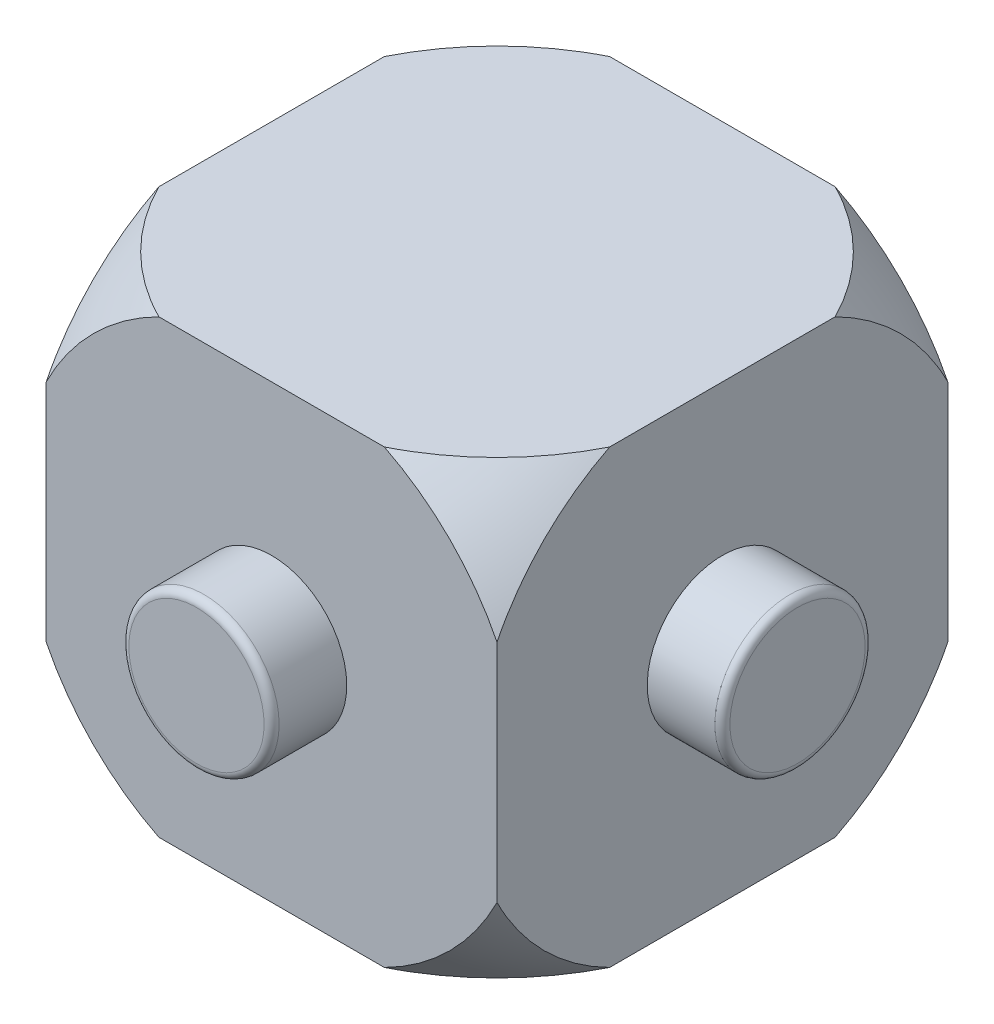
ISO-10303-21;
HEADER;
FILE_DESCRIPTION(('STEP AP214'),'2;1');
FILE_NAME('part.step','',(''),(''),'','','');
FILE_SCHEMA(('AUTOMOTIVE_DESIGN { 1 0 10303 214 1 1 1 1 }'));
ENDSEC;
DATA;
#1=APPLICATION_CONTEXT('core data for automotive mechanical design processes');
#2=APPLICATION_PROTOCOL_DEFINITION('international standard','automotive_design',2000,#1);
#3=PRODUCT_CONTEXT('',#1,'mechanical');
#4=PRODUCT('Part','Part','',(#3));
#5=PRODUCT_RELATED_PRODUCT_CATEGORY('part','',(#4));
#6=PRODUCT_DEFINITION_FORMATION('','',#4);
#7=PRODUCT_DEFINITION_CONTEXT('part definition',#1,'design');
#8=PRODUCT_DEFINITION('design','',#6,#7);
#9=PRODUCT_DEFINITION_SHAPE('','',#8);
#10=(LENGTH_UNIT() NAMED_UNIT(*) SI_UNIT(.MILLI.,.METRE.));
#11=(NAMED_UNIT(*) PLANE_ANGLE_UNIT() SI_UNIT($,.RADIAN.));
#12=(NAMED_UNIT(*) SI_UNIT($,.STERADIAN.) SOLID_ANGLE_UNIT());
#13=UNCERTAINTY_MEASURE_WITH_UNIT(LENGTH_MEASURE(1.E-05),#10,'distance_accuracy_value','');
#14=(GEOMETRIC_REPRESENTATION_CONTEXT(3) GLOBAL_UNCERTAINTY_ASSIGNED_CONTEXT((#13)) GLOBAL_UNIT_ASSIGNED_CONTEXT((#10,
#11,#12)) REPRESENTATION_CONTEXT('',''));
#15=CARTESIAN_POINT('',(0.,0.,0.));
#16=DIRECTION('',(0.,0.,1.));
#17=DIRECTION('',(1.,0.,0.));
#18=AXIS2_PLACEMENT_3D('',#15,#16,#17);
#19=CARTESIAN_POINT('',(3.,3.,3.));
#20=DIRECTION('',(-1.,0.,0.));
#21=DIRECTION('',(0.,-1.,0.));
#22=AXIS2_PLACEMENT_3D('',#19,#20,#21);
#23=PLANE('',#22);
#24=DIRECTION('',(0.,0.,-1.));
#25=VECTOR('',#24,1.);
#26=CARTESIAN_POINT('',(3.,-3.,3.));
#27=LINE('',#26,#25);
#28=CARTESIAN_POINT('',(3.,-3.,1.5));
#29=VERTEX_POINT('',#28);
#30=CARTESIAN_POINT('',(3.,-3.,-1.5));
#31=VERTEX_POINT('',#30);
#32=EDGE_CURVE('E166',#29,#31,#27,.T.);
#33=ORIENTED_EDGE('',*,*,#32,.T.);
#34=CARTESIAN_POINT('',(3.,0.,0.));
#35=DIRECTION('',(-1.,0.,0.));
#36=DIRECTION('',(0.,-1.,0.));
#37=AXIS2_PLACEMENT_3D('',#34,#35,#36);
#38=CIRCLE('',#37,3.35410196624968);
#39=CARTESIAN_POINT('',(3.,-1.5,-3.));
#40=VERTEX_POINT('',#39);
#41=EDGE_CURVE('E288',#31,#40,#38,.F.);
#42=ORIENTED_EDGE('',*,*,#41,.T.);
#43=DIRECTION('',(0.,1.,0.));
#44=VECTOR('',#43,1.);
#45=CARTESIAN_POINT('',(3.,3.,-3.));
#46=LINE('',#45,#44);
#47=CARTESIAN_POINT('',(3.,1.5,-3.));
#48=VERTEX_POINT('',#47);
#49=EDGE_CURVE('E154',#40,#48,#46,.T.);
#50=ORIENTED_EDGE('',*,*,#49,.T.);
#51=CARTESIAN_POINT('',(3.,3.,-1.5));
#52=VERTEX_POINT('',#51);
#53=EDGE_CURVE('E128',#48,#52,#38,.F.);
#54=ORIENTED_EDGE('',*,*,#53,.T.);
#55=DIRECTION('',(0.,0.,-1.));
#56=VECTOR('',#55,1.);
#57=CARTESIAN_POINT('',(3.,3.,3.));
#58=LINE('',#57,#56);
#59=CARTESIAN_POINT('',(3.,3.,1.5));
#60=VERTEX_POINT('',#59);
#61=EDGE_CURVE('E134',#60,#52,#58,.T.);
#62=ORIENTED_EDGE('',*,*,#61,.F.);
#63=CARTESIAN_POINT('',(3.,1.5,3.));
#64=VERTEX_POINT('',#63);
#65=EDGE_CURVE('E502',#60,#64,#38,.F.);
#66=ORIENTED_EDGE('',*,*,#65,.T.);
#67=DIRECTION('',(0.,1.,0.));
#68=VECTOR('',#67,1.);
#69=CARTESIAN_POINT('',(3.,3.,3.));
#70=LINE('',#69,#68);
#71=CARTESIAN_POINT('',(3.,-1.5,3.));
#72=VERTEX_POINT('',#71);
#73=EDGE_CURVE('E165',#72,#64,#70,.T.);
#74=ORIENTED_EDGE('',*,*,#73,.F.);
#75=EDGE_CURVE('E159',#72,#29,#38,.F.);
#76=ORIENTED_EDGE('',*,*,#75,.T.);
#77=EDGE_LOOP('',(#33,#42,#50,#54,#62,#66,#74,#76));
#78=FACE_BOUND('',#77,.T.);
#79=CARTESIAN_POINT('',(3.,0.,0.));
#80=DIRECTION('',(-1.,0.,0.));
#81=DIRECTION('',(0.,-1.,0.));
#82=AXIS2_PLACEMENT_3D('',#79,#80,#81);
#83=CIRCLE('',#82,1.);
#84=CARTESIAN_POINT('',(3.,-1.,0.));
#85=VERTEX_POINT('',#84);
#86=EDGE_CURVE('E183',#85,#85,#83,.F.);
#87=ORIENTED_EDGE('',*,*,#86,.F.);
#88=EDGE_LOOP('',(#87));
#89=FACE_BOUND('',#88,.T.);
#90=ADVANCED_FACE('F35',(#78,#89),#23,.F.);
#91=CARTESIAN_POINT('',(-3.,3.,3.));
#92=DIRECTION('',(1.,0.,0.));
#93=DIRECTION('',(0.,1.,0.));
#94=AXIS2_PLACEMENT_3D('',#91,#92,#93);
#95=PLANE('',#94);
#96=DIRECTION('',(0.,0.,-1.));
#97=VECTOR('',#96,1.);
#98=CARTESIAN_POINT('',(-3.,3.,3.));
#99=LINE('',#98,#97);
#100=CARTESIAN_POINT('',(-3.,3.,1.5));
#101=VERTEX_POINT('',#100);
#102=CARTESIAN_POINT('',(-3.,3.,-1.5));
#103=VERTEX_POINT('',#102);
#104=EDGE_CURVE('E173',#101,#103,#99,.T.);
#105=ORIENTED_EDGE('',*,*,#104,.T.);
#106=CARTESIAN_POINT('',(-3.,0.,0.));
#107=DIRECTION('',(1.,0.,0.));
#108=DIRECTION('',(0.,1.,0.));
#109=AXIS2_PLACEMENT_3D('',#106,#107,#108);
#110=CIRCLE('',#109,3.35410196624968);
#111=CARTESIAN_POINT('',(-3.,1.5,-3.));
#112=VERTEX_POINT('',#111);
#113=EDGE_CURVE('E296',#103,#112,#110,.F.);
#114=ORIENTED_EDGE('',*,*,#113,.T.);
#115=DIRECTION('',(0.,-1.,0.));
#116=VECTOR('',#115,1.);
#117=CARTESIAN_POINT('',(-3.,3.,-3.));
#118=LINE('',#117,#116);
#119=CARTESIAN_POINT('',(-3.,-1.5,-3.));
#120=VERTEX_POINT('',#119);
#121=EDGE_CURVE('E153',#112,#120,#118,.T.);
#122=ORIENTED_EDGE('',*,*,#121,.T.);
#123=CARTESIAN_POINT('',(-3.,-3.,-1.5));
#124=VERTEX_POINT('',#123);
#125=EDGE_CURVE('E294',#120,#124,#110,.F.);
#126=ORIENTED_EDGE('',*,*,#125,.T.);
#127=DIRECTION('',(0.,0.,-1.));
#128=VECTOR('',#127,1.);
#129=CARTESIAN_POINT('',(-3.,-3.,3.));
#130=LINE('',#129,#128);
#131=CARTESIAN_POINT('',(-3.,-3.,1.5));
#132=VERTEX_POINT('',#131);
#133=EDGE_CURVE('E169',#132,#124,#130,.T.);
#134=ORIENTED_EDGE('',*,*,#133,.F.);
#135=CARTESIAN_POINT('',(-3.,-1.5,3.));
#136=VERTEX_POINT('',#135);
#137=EDGE_CURVE('E299',#132,#136,#110,.F.);
#138=ORIENTED_EDGE('',*,*,#137,.T.);
#139=DIRECTION('',(0.,-1.,0.));
#140=VECTOR('',#139,1.);
#141=CARTESIAN_POINT('',(-3.,3.,3.));
#142=LINE('',#141,#140);
#143=CARTESIAN_POINT('',(-3.,1.5,3.));
#144=VERTEX_POINT('',#143);
#145=EDGE_CURVE('E276',#144,#136,#142,.T.);
#146=ORIENTED_EDGE('',*,*,#145,.F.);
#147=EDGE_CURVE('E58',#144,#101,#110,.F.);
#148=ORIENTED_EDGE('',*,*,#147,.T.);
#149=EDGE_LOOP('',(#105,#114,#122,#126,#134,#138,#146,#148));
#150=FACE_BOUND('',#149,.T.);
#151=CARTESIAN_POINT('',(-3.,0.,0.));
#152=DIRECTION('',(1.,0.,0.));
#153=DIRECTION('',(0.,1.,0.));
#154=AXIS2_PLACEMENT_3D('',#151,#152,#153);
#155=CIRCLE('',#154,1.);
#156=CARTESIAN_POINT('',(-3.,1.,0.));
#157=VERTEX_POINT('',#156);
#158=EDGE_CURVE('E180',#157,#157,#155,.F.);
#159=ORIENTED_EDGE('',*,*,#158,.F.);
#160=EDGE_LOOP('',(#159));
#161=FACE_BOUND('',#160,.T.);
#162=ADVANCED_FACE('F216',(#150,#161),#95,.F.);
#163=CARTESIAN_POINT('',(0.,0.,3.));
#164=DIRECTION('',(0.,0.,1.));
#165=DIRECTION('',(1.,0.,0.));
#166=AXIS2_PLACEMENT_3D('',#163,#164,#165);
#167=PLANE('',#166);
#168=CARTESIAN_POINT('',(0.,0.,3.));
#169=DIRECTION('',(0.,0.,1.));
#170=DIRECTION('',(1.,0.,0.));
#171=AXIS2_PLACEMENT_3D('',#168,#169,#170);
#172=CIRCLE('',#171,3.35410196624968);
#173=CARTESIAN_POINT('',(1.5,-3.,3.));
#174=VERTEX_POINT('',#173);
#175=EDGE_CURVE('E289',#72,#174,#172,.F.);
#176=ORIENTED_EDGE('',*,*,#175,.F.);
#177=ORIENTED_EDGE('',*,*,#73,.T.);
#178=CARTESIAN_POINT('',(1.5,3.,3.));
#179=VERTEX_POINT('',#178);
#180=EDGE_CURVE('E285',#179,#64,#172,.F.);
#181=ORIENTED_EDGE('',*,*,#180,.F.);
#182=DIRECTION('',(-1.,0.,0.));
#183=VECTOR('',#182,1.);
#184=CARTESIAN_POINT('',(-3.,3.,3.));
#185=LINE('',#184,#183);
#186=CARTESIAN_POINT('',(-1.5,3.,3.));
#187=VERTEX_POINT('',#186);
#188=EDGE_CURVE('E278',#179,#187,#185,.T.);
#189=ORIENTED_EDGE('',*,*,#188,.T.);
#190=EDGE_CURVE('E290',#144,#187,#172,.F.);
#191=ORIENTED_EDGE('',*,*,#190,.F.);
#192=ORIENTED_EDGE('',*,*,#145,.T.);
#193=CARTESIAN_POINT('',(-1.5,-3.,3.));
#194=VERTEX_POINT('',#193);
#195=EDGE_CURVE('E501',#194,#136,#172,.F.);
#196=ORIENTED_EDGE('',*,*,#195,.F.);
#197=DIRECTION('',(1.,0.,0.));
#198=VECTOR('',#197,1.);
#199=CARTESIAN_POINT('',(-3.,-3.,3.));
#200=LINE('',#199,#198);
#201=EDGE_CURVE('E170',#194,#174,#200,.T.);
#202=ORIENTED_EDGE('',*,*,#201,.T.);
#203=EDGE_LOOP('',(#176,#177,#181,#189,#191,#192,#196,#202));
#204=FACE_BOUND('',#203,.T.);
#205=CARTESIAN_POINT('',(0.,0.,3.));
#206=DIRECTION('',(0.,0.,1.));
#207=DIRECTION('',(1.,0.,0.));
#208=AXIS2_PLACEMENT_3D('',#205,#206,#207);
#209=CIRCLE('',#208,1.);
#210=CARTESIAN_POINT('',(1.,0.,3.));
#211=VERTEX_POINT('',#210);
#212=EDGE_CURVE('E145',#211,#211,#209,.F.);
#213=ORIENTED_EDGE('',*,*,#212,.T.);
#214=EDGE_LOOP('',(#213));
#215=FACE_BOUND('',#214,.T.);
#216=ADVANCED_FACE('F223',(#204,#215),#167,.T.);
#217=CARTESIAN_POINT('',(0.,0.,-3.));
#218=DIRECTION('',(0.,0.,1.));
#219=DIRECTION('',(1.,0.,0.));
#220=AXIS2_PLACEMENT_3D('',#217,#218,#219);
#221=PLANE('',#220);
#222=ORIENTED_EDGE('',*,*,#49,.F.);
#223=CARTESIAN_POINT('',(0.,0.,-3.));
#224=DIRECTION('',(0.,0.,1.));
#225=DIRECTION('',(1.,0.,0.));
#226=AXIS2_PLACEMENT_3D('',#223,#224,#225);
#227=CIRCLE('',#226,3.35410196624968);
#228=CARTESIAN_POINT('',(1.5,-3.,-3.));
#229=VERTEX_POINT('',#228);
#230=EDGE_CURVE('E136',#40,#229,#227,.F.);
#231=ORIENTED_EDGE('',*,*,#230,.T.);
#232=DIRECTION('',(1.,0.,0.));
#233=VECTOR('',#232,1.);
#234=CARTESIAN_POINT('',(-3.,-3.,-3.));
#235=LINE('',#234,#233);
#236=CARTESIAN_POINT('',(-1.5,-3.,-3.));
#237=VERTEX_POINT('',#236);
#238=EDGE_CURVE('E157',#237,#229,#235,.T.);
#239=ORIENTED_EDGE('',*,*,#238,.F.);
#240=EDGE_CURVE('E489',#237,#120,#227,.F.);
#241=ORIENTED_EDGE('',*,*,#240,.T.);
#242=ORIENTED_EDGE('',*,*,#121,.F.);
#243=CARTESIAN_POINT('',(-1.5,3.,-3.));
#244=VERTEX_POINT('',#243);
#245=EDGE_CURVE('E133',#112,#244,#227,.F.);
#246=ORIENTED_EDGE('',*,*,#245,.T.);
#247=DIRECTION('',(-1.,0.,0.));
#248=VECTOR('',#247,1.);
#249=CARTESIAN_POINT('',(-3.,3.,-3.));
#250=LINE('',#249,#248);
#251=CARTESIAN_POINT('',(1.5,3.,-3.));
#252=VERTEX_POINT('',#251);
#253=EDGE_CURVE('E142',#252,#244,#250,.T.);
#254=ORIENTED_EDGE('',*,*,#253,.F.);
#255=EDGE_CURVE('E123',#252,#48,#227,.F.);
#256=ORIENTED_EDGE('',*,*,#255,.T.);
#257=EDGE_LOOP('',(#222,#231,#239,#241,#242,#246,#254,#256));
#258=FACE_BOUND('',#257,.T.);
#259=CARTESIAN_POINT('',(0.,0.,-3.));
#260=DIRECTION('',(0.,0.,1.));
#261=DIRECTION('',(1.,0.,0.));
#262=AXIS2_PLACEMENT_3D('',#259,#260,#261);
#263=CIRCLE('',#262,1.);
#264=CARTESIAN_POINT('',(1.,0.,-3.));
#265=VERTEX_POINT('',#264);
#266=EDGE_CURVE('E177',#265,#265,#263,.F.);
#267=ORIENTED_EDGE('',*,*,#266,.F.);
#268=EDGE_LOOP('',(#267));
#269=FACE_BOUND('',#268,.T.);
#270=ADVANCED_FACE('F150',(#258,#269),#221,.F.);
#271=CARTESIAN_POINT('',(0.,0.,0.));
#272=DIRECTION('',(0.,0.,-1.));
#273=DIRECTION('',(1.,0.,0.));
#274=AXIS2_PLACEMENT_3D('',#271,#272,#273);
#275=SPHERICAL_SURFACE('',#274,4.5);
#276=ORIENTED_EDGE('',*,*,#175,.T.);
#277=CARTESIAN_POINT('',(0.,-3.,0.));
#278=DIRECTION('',(0.,1.,0.));
#279=DIRECTION('',(0.,0.,1.));
#280=AXIS2_PLACEMENT_3D('',#277,#278,#279);
#281=CIRCLE('',#280,3.35410196624968);
#282=EDGE_CURVE('E274',#29,#174,#281,.F.);
#283=ORIENTED_EDGE('',*,*,#282,.F.);
#284=ORIENTED_EDGE('',*,*,#75,.F.);
#285=EDGE_LOOP('',(#276,#283,#284));
#286=FACE_BOUND('',#285,.T.);
#287=ADVANCED_FACE('F249',(#286),#275,.T.);
#288=CARTESIAN_POINT('',(-3.,3.,3.));
#289=DIRECTION('',(0.,-1.,0.));
#290=DIRECTION('',(0.,0.,-1.));
#291=AXIS2_PLACEMENT_3D('',#288,#289,#290);
#292=PLANE('',#291);
#293=ORIENTED_EDGE('',*,*,#253,.T.);
#294=CARTESIAN_POINT('',(0.,3.,0.));
#295=DIRECTION('',(0.,-1.,0.));
#296=DIRECTION('',(0.,0.,-1.));
#297=AXIS2_PLACEMENT_3D('',#294,#295,#296);
#298=CIRCLE('',#297,3.35410196624968);
#299=EDGE_CURVE('E148',#244,#103,#298,.F.);
#300=ORIENTED_EDGE('',*,*,#299,.T.);
#301=ORIENTED_EDGE('',*,*,#104,.F.);
#302=EDGE_CURVE('E147',#101,#187,#298,.F.);
#303=ORIENTED_EDGE('',*,*,#302,.T.);
#304=ORIENTED_EDGE('',*,*,#188,.F.);
#305=EDGE_CURVE('E287',#179,#60,#298,.F.);
#306=ORIENTED_EDGE('',*,*,#305,.T.);
#307=ORIENTED_EDGE('',*,*,#61,.T.);
#308=EDGE_CURVE('E126',#52,#252,#298,.F.);
#309=ORIENTED_EDGE('',*,*,#308,.T.);
#310=EDGE_LOOP('',(#293,#300,#301,#303,#304,#306,#307,#309));
#311=FACE_BOUND('',#310,.T.);
#312=ADVANCED_FACE('F140',(#311),#292,.F.);
#313=CARTESIAN_POINT('',(-3.,-3.,3.));
#314=DIRECTION('',(0.,1.,0.));
#315=DIRECTION('',(0.,0.,1.));
#316=AXIS2_PLACEMENT_3D('',#313,#314,#315);
#317=PLANE('',#316);
#318=ORIENTED_EDGE('',*,*,#201,.F.);
#319=EDGE_CURVE('E50',#194,#132,#281,.F.);
#320=ORIENTED_EDGE('',*,*,#319,.T.);
#321=ORIENTED_EDGE('',*,*,#133,.T.);
#322=EDGE_CURVE('E291',#124,#237,#281,.F.);
#323=ORIENTED_EDGE('',*,*,#322,.T.);
#324=ORIENTED_EDGE('',*,*,#238,.T.);
#325=EDGE_CURVE('E295',#229,#31,#281,.F.);
#326=ORIENTED_EDGE('',*,*,#325,.T.);
#327=ORIENTED_EDGE('',*,*,#32,.F.);
#328=ORIENTED_EDGE('',*,*,#282,.T.);
#329=EDGE_LOOP('',(#318,#320,#321,#323,#324,#326,#327,#328));
#330=FACE_BOUND('',#329,.T.);
#331=ADVANCED_FACE('F261',(#330),#317,.F.);
#332=ORIENTED_EDGE('',*,*,#255,.F.);
#333=ORIENTED_EDGE('',*,*,#308,.F.);
#334=ORIENTED_EDGE('',*,*,#53,.F.);
#335=EDGE_LOOP('',(#332,#333,#334));
#336=FACE_BOUND('',#335,.T.);
#337=ADVANCED_FACE('F125',(#336),#275,.T.);
#338=ORIENTED_EDGE('',*,*,#245,.F.);
#339=ORIENTED_EDGE('',*,*,#113,.F.);
#340=ORIENTED_EDGE('',*,*,#299,.F.);
#341=EDGE_LOOP('',(#338,#339,#340));
#342=FACE_BOUND('',#341,.T.);
#343=ADVANCED_FACE('F268',(#342),#275,.T.);
#344=ORIENTED_EDGE('',*,*,#240,.F.);
#345=ORIENTED_EDGE('',*,*,#322,.F.);
#346=ORIENTED_EDGE('',*,*,#125,.F.);
#347=EDGE_LOOP('',(#344,#345,#346));
#348=FACE_BOUND('',#347,.T.);
#349=ADVANCED_FACE('F445',(#348),#275,.T.);
#350=ORIENTED_EDGE('',*,*,#325,.F.);
#351=ORIENTED_EDGE('',*,*,#230,.F.);
#352=ORIENTED_EDGE('',*,*,#41,.F.);
#353=EDGE_LOOP('',(#350,#351,#352));
#354=FACE_BOUND('',#353,.T.);
#355=ADVANCED_FACE('F437',(#354),#275,.T.);
#356=ORIENTED_EDGE('',*,*,#305,.F.);
#357=ORIENTED_EDGE('',*,*,#180,.T.);
#358=ORIENTED_EDGE('',*,*,#65,.F.);
#359=EDGE_LOOP('',(#356,#357,#358));
#360=FACE_BOUND('',#359,.T.);
#361=ADVANCED_FACE('F430',(#360),#275,.T.);
#362=ORIENTED_EDGE('',*,*,#147,.F.);
#363=ORIENTED_EDGE('',*,*,#190,.T.);
#364=ORIENTED_EDGE('',*,*,#302,.F.);
#365=EDGE_LOOP('',(#362,#363,#364));
#366=FACE_BOUND('',#365,.T.);
#367=ADVANCED_FACE('F423',(#366),#275,.T.);
#368=ORIENTED_EDGE('',*,*,#319,.F.);
#369=ORIENTED_EDGE('',*,*,#195,.T.);
#370=ORIENTED_EDGE('',*,*,#137,.F.);
#371=EDGE_LOOP('',(#368,#369,#370));
#372=FACE_BOUND('',#371,.T.);
#373=ADVANCED_FACE('F257',(#372),#275,.T.);
#374=CARTESIAN_POINT('',(0.,0.,-4.));
#375=DIRECTION('',(0.,0.,1.));
#376=DIRECTION('',(1.,0.,0.));
#377=AXIS2_PLACEMENT_3D('',#374,#375,#376);
#378=PLANE('',#377);
#379=CARTESIAN_POINT('',(0.,0.,-4.));
#380=DIRECTION('',(0.,0.,1.));
#381=DIRECTION('',(1.,0.,0.));
#382=AXIS2_PLACEMENT_3D('',#379,#380,#381);
#383=CIRCLE('',#382,0.9);
#384=CARTESIAN_POINT('',(0.9,0.,-4.));
#385=VERTEX_POINT('',#384);
#386=EDGE_CURVE('E193',#385,#385,#383,.F.);
#387=ORIENTED_EDGE('',*,*,#386,.T.);
#388=EDGE_LOOP('',(#387));
#389=FACE_BOUND('',#388,.T.);
#390=ADVANCED_FACE('F246',(#389),#378,.F.);
#391=CARTESIAN_POINT('',(0.,0.,4.));
#392=DIRECTION('',(0.,0.,-1.));
#393=DIRECTION('',(-1.,0.,0.));
#394=AXIS2_PLACEMENT_3D('',#391,#392,#393);
#395=CYLINDRICAL_SURFACE('',#394,1.);
#396=CARTESIAN_POINT('',(0.,0.,-3.9));
#397=DIRECTION('',(0.,0.,1.));
#398=DIRECTION('',(1.,0.,0.));
#399=AXIS2_PLACEMENT_3D('',#396,#397,#398);
#400=CIRCLE('',#399,1.);
#401=CARTESIAN_POINT('',(1.,0.,-3.9));
#402=VERTEX_POINT('',#401);
#403=EDGE_CURVE('E190',#402,#402,#400,.T.);
#404=ORIENTED_EDGE('',*,*,#403,.T.);
#405=EDGE_LOOP('',(#404));
#406=FACE_BOUND('',#405,.T.);
#407=ORIENTED_EDGE('',*,*,#266,.T.);
#408=EDGE_LOOP('',(#407));
#409=FACE_BOUND('',#408,.T.);
#410=ADVANCED_FACE('F242',(#406,#409),#395,.T.);
#411=CARTESIAN_POINT('',(0.,0.,3.9));
#412=DIRECTION('',(0.,0.,1.));
#413=DIRECTION('',(1.,0.,0.));
#414=AXIS2_PLACEMENT_3D('',#411,#412,#413);
#415=CIRCLE('',#414,1.);
#416=CARTESIAN_POINT('',(1.,0.,3.9));
#417=VERTEX_POINT('',#416);
#418=EDGE_CURVE('E11',#417,#417,#415,.F.);
#419=ORIENTED_EDGE('',*,*,#418,.T.);
#420=EDGE_LOOP('',(#419));
#421=FACE_BOUND('',#420,.T.);
#422=ORIENTED_EDGE('',*,*,#212,.F.);
#423=EDGE_LOOP('',(#422));
#424=FACE_BOUND('',#423,.T.);
#425=ADVANCED_FACE('F245',(#421,#424),#395,.T.);
#426=CARTESIAN_POINT('',(0.,0.,4.));
#427=DIRECTION('',(0.,0.,1.));
#428=DIRECTION('',(1.,0.,0.));
#429=AXIS2_PLACEMENT_3D('',#426,#427,#428);
#430=PLANE('',#429);
#431=CARTESIAN_POINT('',(0.,0.,4.));
#432=DIRECTION('',(0.,0.,1.));
#433=DIRECTION('',(1.,0.,0.));
#434=AXIS2_PLACEMENT_3D('',#431,#432,#433);
#435=CIRCLE('',#434,0.9);
#436=CARTESIAN_POINT('',(0.9,0.,4.));
#437=VERTEX_POINT('',#436);
#438=EDGE_CURVE('E43',#437,#437,#435,.T.);
#439=ORIENTED_EDGE('',*,*,#438,.T.);
#440=EDGE_LOOP('',(#439));
#441=FACE_BOUND('',#440,.T.);
#442=ADVANCED_FACE('F204',(#441),#430,.T.);
#443=CARTESIAN_POINT('',(-4.,0.,0.));
#444=DIRECTION('',(1.,0.,0.));
#445=DIRECTION('',(0.,0.,-1.));
#446=AXIS2_PLACEMENT_3D('',#443,#444,#445);
#447=PLANE('',#446);
#448=CARTESIAN_POINT('',(-4.,0.,0.));
#449=DIRECTION('',(1.,0.,0.));
#450=DIRECTION('',(0.,0.,-1.));
#451=AXIS2_PLACEMENT_3D('',#448,#449,#450);
#452=CIRCLE('',#451,0.9);
#453=CARTESIAN_POINT('',(-4.,0.,-0.9));
#454=VERTEX_POINT('',#453);
#455=EDGE_CURVE('E199',#454,#454,#452,.F.);
#456=ORIENTED_EDGE('',*,*,#455,.T.);
#457=EDGE_LOOP('',(#456));
#458=FACE_BOUND('',#457,.T.);
#459=ADVANCED_FACE('F317',(#458),#447,.F.);
#460=CARTESIAN_POINT('',(4.,0.,0.));
#461=DIRECTION('',(-1.,0.,0.));
#462=DIRECTION('',(0.,0.,1.));
#463=AXIS2_PLACEMENT_3D('',#460,#461,#462);
#464=CYLINDRICAL_SURFACE('',#463,1.);
#465=CARTESIAN_POINT('',(-3.9,0.,0.));
#466=DIRECTION('',(1.,0.,0.));
#467=DIRECTION('',(0.,0.,-1.));
#468=AXIS2_PLACEMENT_3D('',#465,#466,#467);
#469=CIRCLE('',#468,1.);
#470=CARTESIAN_POINT('',(-3.9,0.,-1.));
#471=VERTEX_POINT('',#470);
#472=EDGE_CURVE('E196',#471,#471,#469,.T.);
#473=ORIENTED_EDGE('',*,*,#472,.T.);
#474=EDGE_LOOP('',(#473));
#475=FACE_BOUND('',#474,.T.);
#476=ORIENTED_EDGE('',*,*,#158,.T.);
#477=EDGE_LOOP('',(#476));
#478=FACE_BOUND('',#477,.T.);
#479=ADVANCED_FACE('F308',(#475,#478),#464,.T.);
#480=CARTESIAN_POINT('',(3.9,0.,0.));
#481=DIRECTION('',(1.,0.,0.));
#482=DIRECTION('',(0.,0.,-1.));
#483=AXIS2_PLACEMENT_3D('',#480,#481,#482);
#484=CIRCLE('',#483,1.);
#485=CARTESIAN_POINT('',(3.9,0.,-1.));
#486=VERTEX_POINT('',#485);
#487=EDGE_CURVE('E187',#486,#486,#484,.F.);
#488=ORIENTED_EDGE('',*,*,#487,.T.);
#489=EDGE_LOOP('',(#488));
#490=FACE_BOUND('',#489,.T.);
#491=ORIENTED_EDGE('',*,*,#86,.T.);
#492=EDGE_LOOP('',(#491));
#493=FACE_BOUND('',#492,.T.);
#494=ADVANCED_FACE('F306',(#490,#493),#464,.T.);
#495=CARTESIAN_POINT('',(4.,0.,0.));
#496=DIRECTION('',(1.,0.,0.));
#497=DIRECTION('',(0.,0.,-1.));
#498=AXIS2_PLACEMENT_3D('',#495,#496,#497);
#499=PLANE('',#498);
#500=CARTESIAN_POINT('',(4.,0.,0.));
#501=DIRECTION('',(1.,0.,0.));
#502=DIRECTION('',(0.,0.,-1.));
#503=AXIS2_PLACEMENT_3D('',#500,#501,#502);
#504=CIRCLE('',#503,0.9);
#505=CARTESIAN_POINT('',(4.,0.,-0.9));
#506=VERTEX_POINT('',#505);
#507=EDGE_CURVE('E184',#506,#506,#504,.T.);
#508=ORIENTED_EDGE('',*,*,#507,.T.);
#509=EDGE_LOOP('',(#508));
#510=FACE_BOUND('',#509,.T.);
#511=ADVANCED_FACE('F232',(#510),#499,.T.);
#512=CARTESIAN_POINT('',(3.9,0.,0.));
#513=DIRECTION('',(1.,0.,0.));
#514=DIRECTION('',(0.,0.,-1.));
#515=AXIS2_PLACEMENT_3D('',#512,#513,#514);
#516=TOROIDAL_SURFACE('',#515,0.9,0.1);
#517=ORIENTED_EDGE('',*,*,#487,.F.);
#518=EDGE_LOOP('',(#517));
#519=FACE_BOUND('',#518,.T.);
#520=ORIENTED_EDGE('',*,*,#507,.F.);
#521=EDGE_LOOP('',(#520));
#522=FACE_BOUND('',#521,.T.);
#523=ADVANCED_FACE('F229',(#519,#522),#516,.T.);
#524=CARTESIAN_POINT('',(0.,0.,-3.9));
#525=DIRECTION('',(0.,0.,1.));
#526=DIRECTION('',(1.,0.,0.));
#527=AXIS2_PLACEMENT_3D('',#524,#525,#526);
#528=TOROIDAL_SURFACE('',#527,0.9,0.1);
#529=ORIENTED_EDGE('',*,*,#386,.F.);
#530=EDGE_LOOP('',(#529));
#531=FACE_BOUND('',#530,.T.);
#532=ORIENTED_EDGE('',*,*,#403,.F.);
#533=EDGE_LOOP('',(#532));
#534=FACE_BOUND('',#533,.T.);
#535=ADVANCED_FACE('F212',(#531,#534),#528,.T.);
#536=CARTESIAN_POINT('',(-3.9,0.,0.));
#537=DIRECTION('',(1.,0.,0.));
#538=DIRECTION('',(0.,0.,-1.));
#539=AXIS2_PLACEMENT_3D('',#536,#537,#538);
#540=TOROIDAL_SURFACE('',#539,0.9,0.1);
#541=ORIENTED_EDGE('',*,*,#455,.F.);
#542=EDGE_LOOP('',(#541));
#543=FACE_BOUND('',#542,.T.);
#544=ORIENTED_EDGE('',*,*,#472,.F.);
#545=EDGE_LOOP('',(#544));
#546=FACE_BOUND('',#545,.T.);
#547=ADVANCED_FACE('F207',(#543,#546),#540,.T.);
#548=CARTESIAN_POINT('',(0.,0.,3.9));
#549=DIRECTION('',(0.,0.,1.));
#550=DIRECTION('',(1.,0.,0.));
#551=AXIS2_PLACEMENT_3D('',#548,#549,#550);
#552=TOROIDAL_SURFACE('',#551,0.9,0.1);
#553=ORIENTED_EDGE('',*,*,#418,.F.);
#554=EDGE_LOOP('',(#553));
#555=FACE_BOUND('',#554,.T.);
#556=ORIENTED_EDGE('',*,*,#438,.F.);
#557=EDGE_LOOP('',(#556));
#558=FACE_BOUND('',#557,.T.);
#559=ADVANCED_FACE('F37',(#555,#558),#552,.T.);
#560=CLOSED_SHELL('',(#90,#162,#216,#270,#287,#312,#331,#337,#343,#349,#355,#361,#367,#373,#390,
#410,#425,#442,#459,#479,#494,#511,#523,#535,#547,#559));
#561=MANIFOLD_SOLID_BREP('B2',#560);
#562=ADVANCED_BREP_SHAPE_REPRESENTATION('',(#18,#561),#14);
#563=SHAPE_DEFINITION_REPRESENTATION(#9,#562);
ENDSEC;
END-ISO-10303-21;
